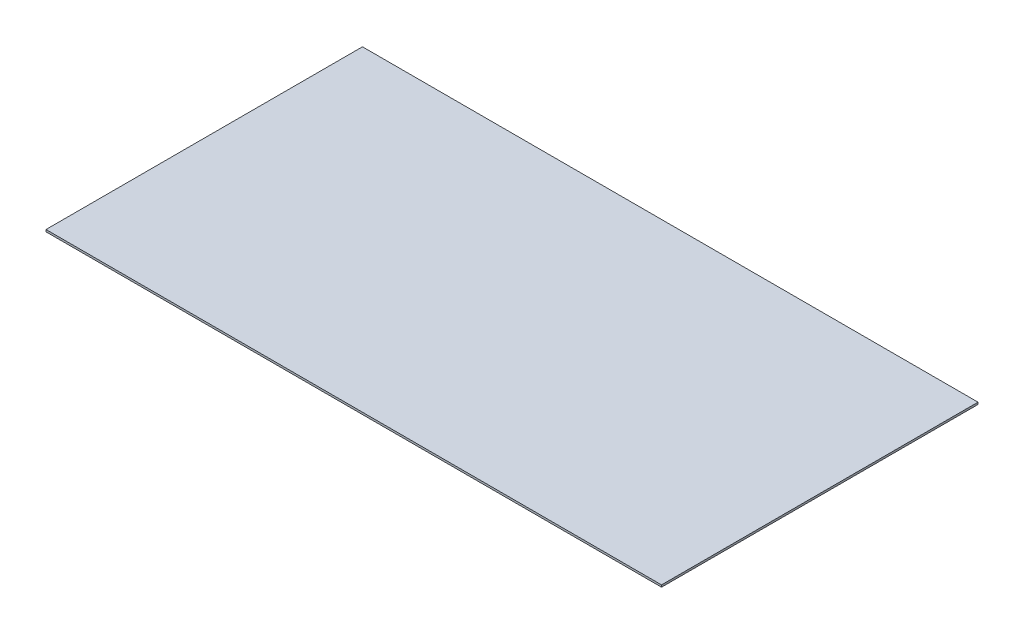
ISO-10303-21;
HEADER;
FILE_DESCRIPTION(('STEP AP214'),'2;1');
FILE_NAME('part.step','',(''),(''),'','','');
FILE_SCHEMA(('AUTOMOTIVE_DESIGN { 1 0 10303 214 1 1 1 1 }'));
ENDSEC;
DATA;
#1=APPLICATION_CONTEXT('core data for automotive mechanical design processes');
#2=APPLICATION_PROTOCOL_DEFINITION('international standard','automotive_design',2000,#1);
#3=PRODUCT_CONTEXT('',#1,'mechanical');
#4=PRODUCT('Part','Part','',(#3));
#5=PRODUCT_RELATED_PRODUCT_CATEGORY('part','',(#4));
#6=PRODUCT_DEFINITION_FORMATION('','',#4);
#7=PRODUCT_DEFINITION_CONTEXT('part definition',#1,'design');
#8=PRODUCT_DEFINITION('design','',#6,#7);
#9=PRODUCT_DEFINITION_SHAPE('','',#8);
#10=(LENGTH_UNIT() NAMED_UNIT(*) SI_UNIT(.MILLI.,.METRE.));
#11=(NAMED_UNIT(*) PLANE_ANGLE_UNIT() SI_UNIT($,.RADIAN.));
#12=(NAMED_UNIT(*) SI_UNIT($,.STERADIAN.) SOLID_ANGLE_UNIT());
#13=UNCERTAINTY_MEASURE_WITH_UNIT(LENGTH_MEASURE(1.E-05),#10,'distance_accuracy_value','');
#14=(GEOMETRIC_REPRESENTATION_CONTEXT(3) GLOBAL_UNCERTAINTY_ASSIGNED_CONTEXT((#13)) GLOBAL_UNIT_ASSIGNED_CONTEXT((#10,
#11,#12)) REPRESENTATION_CONTEXT('',''));
#15=CARTESIAN_POINT('',(0.,0.,0.));
#16=DIRECTION('',(0.,0.,1.));
#17=DIRECTION('',(1.,0.,0.));
#18=AXIS2_PLACEMENT_3D('',#15,#16,#17);
#19=CARTESIAN_POINT('',(151.592980370775,1.,77.936239093987));
#20=DIRECTION('',(-1.,0.,0.));
#21=DIRECTION('',(0.,0.,1.));
#22=AXIS2_PLACEMENT_3D('',#19,#20,#21);
#23=PLANE('',#22);
#24=DIRECTION('',(0.,0.,-1.));
#25=VECTOR('',#24,1.);
#26=CARTESIAN_POINT('',(151.592980370775,0.,77.936239093987));
#27=LINE('',#26,#25);
#28=CARTESIAN_POINT('',(151.592980370775,0.,77.936239093987));
#29=VERTEX_POINT('',#28);
#30=CARTESIAN_POINT('',(151.592980370775,0.,-77.936239093987));
#31=VERTEX_POINT('',#30);
#32=EDGE_CURVE('E95',#29,#31,#27,.T.);
#33=ORIENTED_EDGE('',*,*,#32,.T.);
#34=DIRECTION('',(0.,-1.,0.));
#35=VECTOR('',#34,1.);
#36=CARTESIAN_POINT('',(151.592980370775,1.,-77.936239093987));
#37=LINE('',#36,#35);
#38=CARTESIAN_POINT('',(151.592980370775,1.,-77.936239093987));
#39=VERTEX_POINT('',#38);
#40=EDGE_CURVE('E11',#39,#31,#37,.T.);
#41=ORIENTED_EDGE('',*,*,#40,.F.);
#42=DIRECTION('',(0.,0.,-1.));
#43=VECTOR('',#42,1.);
#44=CARTESIAN_POINT('',(151.592980370775,1.,77.936239093987));
#45=LINE('',#44,#43);
#46=CARTESIAN_POINT('',(151.592980370775,1.,77.936239093987));
#47=VERTEX_POINT('',#46);
#48=EDGE_CURVE('E83',#47,#39,#45,.T.);
#49=ORIENTED_EDGE('',*,*,#48,.F.);
#50=DIRECTION('',(0.,-1.,0.));
#51=VECTOR('',#50,1.);
#52=CARTESIAN_POINT('',(151.592980370775,1.,77.936239093987));
#53=LINE('',#52,#51);
#54=EDGE_CURVE('E91',#47,#29,#53,.T.);
#55=ORIENTED_EDGE('',*,*,#54,.T.);
#56=EDGE_LOOP('',(#33,#41,#49,#55));
#57=FACE_BOUND('',#56,.T.);
#58=ADVANCED_FACE('F32',(#57),#23,.F.);
#59=CARTESIAN_POINT('',(-151.592980370775,1.,-77.936239093987));
#60=DIRECTION('',(0.,0.,1.));
#61=DIRECTION('',(1.,0.,0.));
#62=AXIS2_PLACEMENT_3D('',#59,#60,#61);
#63=PLANE('',#62);
#64=DIRECTION('',(-1.,0.,0.));
#65=VECTOR('',#64,1.);
#66=CARTESIAN_POINT('',(-151.592980370775,0.,-77.936239093987));
#67=LINE('',#66,#65);
#68=CARTESIAN_POINT('',(-151.592980370775,0.,-77.936239093987));
#69=VERTEX_POINT('',#68);
#70=EDGE_CURVE('E87',#31,#69,#67,.T.);
#71=ORIENTED_EDGE('',*,*,#70,.T.);
#72=DIRECTION('',(0.,-1.,0.));
#73=VECTOR('',#72,1.);
#74=CARTESIAN_POINT('',(-151.592980370775,1.,-77.936239093987));
#75=LINE('',#74,#73);
#76=CARTESIAN_POINT('',(-151.592980370775,1.,-77.936239093987));
#77=VERTEX_POINT('',#76);
#78=EDGE_CURVE('E40',#77,#69,#75,.T.);
#79=ORIENTED_EDGE('',*,*,#78,.F.);
#80=DIRECTION('',(-1.,0.,0.));
#81=VECTOR('',#80,1.);
#82=CARTESIAN_POINT('',(-151.592980370775,1.,-77.936239093987));
#83=LINE('',#82,#81);
#84=EDGE_CURVE('E78',#39,#77,#83,.T.);
#85=ORIENTED_EDGE('',*,*,#84,.F.);
#86=ORIENTED_EDGE('',*,*,#40,.T.);
#87=EDGE_LOOP('',(#71,#79,#85,#86));
#88=FACE_BOUND('',#87,.T.);
#89=ADVANCED_FACE('F86',(#88),#63,.F.);
#90=CARTESIAN_POINT('',(-151.592980370775,1.,77.936239093987));
#91=DIRECTION('',(1.,0.,0.));
#92=DIRECTION('',(0.,0.,-1.));
#93=AXIS2_PLACEMENT_3D('',#90,#91,#92);
#94=PLANE('',#93);
#95=DIRECTION('',(0.,0.,1.));
#96=VECTOR('',#95,1.);
#97=CARTESIAN_POINT('',(-151.592980370775,0.,77.936239093987));
#98=LINE('',#97,#96);
#99=CARTESIAN_POINT('',(-151.592980370775,0.,77.936239093987));
#100=VERTEX_POINT('',#99);
#101=EDGE_CURVE('E65',#69,#100,#98,.T.);
#102=ORIENTED_EDGE('',*,*,#101,.T.);
#103=DIRECTION('',(0.,-1.,0.));
#104=VECTOR('',#103,1.);
#105=CARTESIAN_POINT('',(-151.592980370775,1.,77.936239093987));
#106=LINE('',#105,#104);
#107=CARTESIAN_POINT('',(-151.592980370775,1.,77.936239093987));
#108=VERTEX_POINT('',#107);
#109=EDGE_CURVE('E88',#108,#100,#106,.T.);
#110=ORIENTED_EDGE('',*,*,#109,.F.);
#111=DIRECTION('',(0.,0.,1.));
#112=VECTOR('',#111,1.);
#113=CARTESIAN_POINT('',(-151.592980370775,1.,77.936239093987));
#114=LINE('',#113,#112);
#115=EDGE_CURVE('E81',#77,#108,#114,.T.);
#116=ORIENTED_EDGE('',*,*,#115,.F.);
#117=ORIENTED_EDGE('',*,*,#78,.T.);
#118=EDGE_LOOP('',(#102,#110,#116,#117));
#119=FACE_BOUND('',#118,.T.);
#120=ADVANCED_FACE('F89',(#119),#94,.F.);
#121=CARTESIAN_POINT('',(-151.592980370775,1.,77.936239093987));
#122=DIRECTION('',(0.,0.,-1.));
#123=DIRECTION('',(-1.,0.,0.));
#124=AXIS2_PLACEMENT_3D('',#121,#122,#123);
#125=PLANE('',#124);
#126=DIRECTION('',(1.,0.,0.));
#127=VECTOR('',#126,1.);
#128=CARTESIAN_POINT('',(-151.592980370775,0.,77.936239093987));
#129=LINE('',#128,#127);
#130=EDGE_CURVE('E71',#100,#29,#129,.T.);
#131=ORIENTED_EDGE('',*,*,#130,.T.);
#132=ORIENTED_EDGE('',*,*,#54,.F.);
#133=DIRECTION('',(1.,0.,0.));
#134=VECTOR('',#133,1.);
#135=CARTESIAN_POINT('',(-151.592980370775,1.,77.936239093987));
#136=LINE('',#135,#134);
#137=EDGE_CURVE('E48',#108,#47,#136,.T.);
#138=ORIENTED_EDGE('',*,*,#137,.F.);
#139=ORIENTED_EDGE('',*,*,#109,.T.);
#140=EDGE_LOOP('',(#131,#132,#138,#139));
#141=FACE_BOUND('',#140,.T.);
#142=ADVANCED_FACE('F102',(#141),#125,.F.);
#143=CARTESIAN_POINT('',(0.,1.,0.));
#144=DIRECTION('',(0.,-1.,0.));
#145=DIRECTION('',(0.,0.,-1.));
#146=AXIS2_PLACEMENT_3D('',#143,#144,#145);
#147=PLANE('',#146);
#148=ORIENTED_EDGE('',*,*,#48,.T.);
#149=ORIENTED_EDGE('',*,*,#84,.T.);
#150=ORIENTED_EDGE('',*,*,#115,.T.);
#151=ORIENTED_EDGE('',*,*,#137,.T.);
#152=EDGE_LOOP('',(#148,#149,#150,#151));
#153=FACE_BOUND('',#152,.T.);
#154=ADVANCED_FACE('F79',(#153),#147,.F.);
#155=CARTESIAN_POINT('',(0.,0.,0.));
#156=DIRECTION('',(0.,-1.,0.));
#157=DIRECTION('',(0.,0.,-1.));
#158=AXIS2_PLACEMENT_3D('',#155,#156,#157);
#159=PLANE('',#158);
#160=ORIENTED_EDGE('',*,*,#32,.F.);
#161=ORIENTED_EDGE('',*,*,#130,.F.);
#162=ORIENTED_EDGE('',*,*,#101,.F.);
#163=ORIENTED_EDGE('',*,*,#70,.F.);
#164=EDGE_LOOP('',(#160,#161,#162,#163));
#165=FACE_BOUND('',#164,.T.);
#166=ADVANCED_FACE('F105',(#165),#159,.T.);
#167=CLOSED_SHELL('',(#58,#89,#120,#142,#154,#166));
#168=MANIFOLD_SOLID_BREP('B2',#167);
#169=ADVANCED_BREP_SHAPE_REPRESENTATION('',(#18,#168),#14);
#170=SHAPE_DEFINITION_REPRESENTATION(#9,#169);
ENDSEC;
END-ISO-10303-21;
